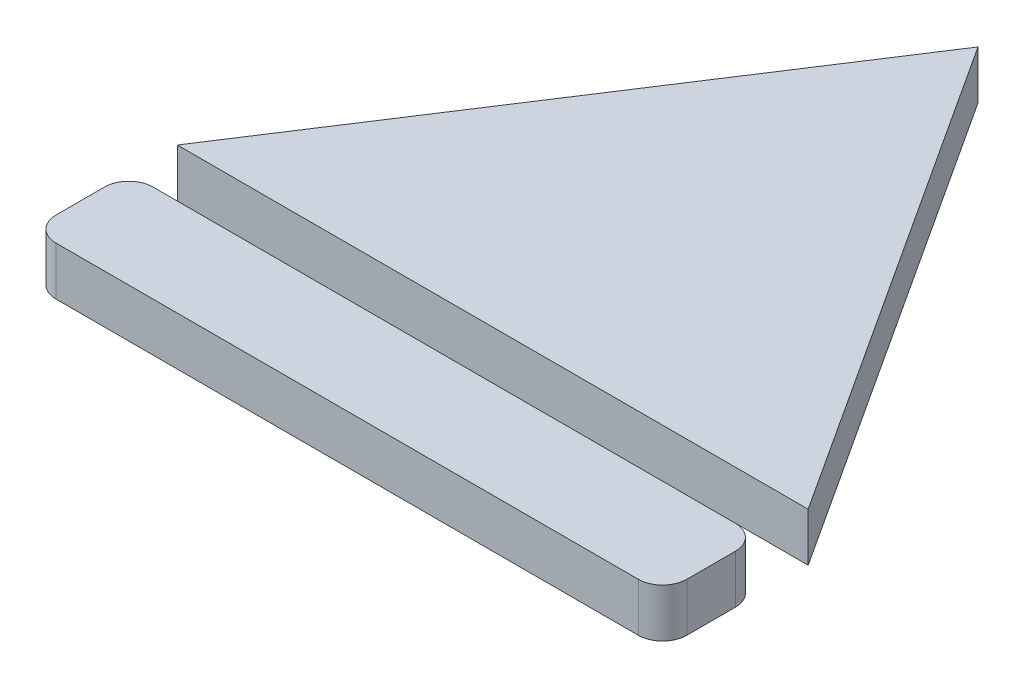
ISO-10303-21;
HEADER;
FILE_DESCRIPTION(('STEP AP214'),'2;1');
FILE_NAME('part.step','',(''),(''),'','','');
FILE_SCHEMA(('AUTOMOTIVE_DESIGN { 1 0 10303 214 1 1 1 1 }'));
ENDSEC;
DATA;
#1=APPLICATION_CONTEXT('core data for automotive mechanical design processes');
#2=APPLICATION_PROTOCOL_DEFINITION('international standard','automotive_design',2000,#1);
#3=PRODUCT_CONTEXT('',#1,'mechanical');
#4=PRODUCT('Part','Part','',(#3));
#5=PRODUCT_RELATED_PRODUCT_CATEGORY('part','',(#4));
#6=PRODUCT_DEFINITION_FORMATION('','',#4);
#7=PRODUCT_DEFINITION_CONTEXT('part definition',#1,'design');
#8=PRODUCT_DEFINITION('design','',#6,#7);
#9=PRODUCT_DEFINITION_SHAPE('','',#8);
#10=(LENGTH_UNIT() NAMED_UNIT(*) SI_UNIT(.MILLI.,.METRE.));
#11=(NAMED_UNIT(*) PLANE_ANGLE_UNIT() SI_UNIT($,.RADIAN.));
#12=(NAMED_UNIT(*) SI_UNIT($,.STERADIAN.) SOLID_ANGLE_UNIT());
#13=UNCERTAINTY_MEASURE_WITH_UNIT(LENGTH_MEASURE(1.E-05),#10,'distance_accuracy_value','');
#14=(GEOMETRIC_REPRESENTATION_CONTEXT(3) GLOBAL_UNCERTAINTY_ASSIGNED_CONTEXT((#13)) GLOBAL_UNIT_ASSIGNED_CONTEXT((#10,
#11,#12)) REPRESENTATION_CONTEXT('',''));
#15=CARTESIAN_POINT('',(0.,0.,0.));
#16=DIRECTION('',(0.,0.,1.));
#17=DIRECTION('',(1.,0.,0.));
#18=AXIS2_PLACEMENT_3D('',#15,#16,#17);
#19=CARTESIAN_POINT('',(12.5,1.,2.5));
#20=DIRECTION('',(0.,-1.,0.));
#21=DIRECTION('',(0.,0.,-1.));
#22=AXIS2_PLACEMENT_3D('',#19,#20,#21);
#23=CYLINDRICAL_SURFACE('',#22,0.5);
#24=CARTESIAN_POINT('',(12.5,0.,2.5));
#25=DIRECTION('',(0.,1.,0.));
#26=DIRECTION('',(0.,0.,1.));
#27=AXIS2_PLACEMENT_3D('',#24,#25,#26);
#28=CIRCLE('',#27,0.5);
#29=CARTESIAN_POINT('',(12.5,0.,3.));
#30=VERTEX_POINT('',#29);
#31=CARTESIAN_POINT('',(13.,0.,2.5));
#32=VERTEX_POINT('',#31);
#33=EDGE_CURVE('E12',#30,#32,#28,.T.);
#34=ORIENTED_EDGE('',*,*,#33,.T.);
#35=DIRECTION('',(0.,-1.,0.));
#36=VECTOR('',#35,1.);
#37=CARTESIAN_POINT('',(13.,1.,2.5));
#38=LINE('',#37,#36);
#39=CARTESIAN_POINT('',(13.,1.,2.5));
#40=VERTEX_POINT('',#39);
#41=EDGE_CURVE('E191',#40,#32,#38,.T.);
#42=ORIENTED_EDGE('',*,*,#41,.F.);
#43=CARTESIAN_POINT('',(12.5,1.,2.5));
#44=DIRECTION('',(0.,1.,0.));
#45=DIRECTION('',(0.,0.,1.));
#46=AXIS2_PLACEMENT_3D('',#43,#44,#45);
#47=CIRCLE('',#46,0.5);
#48=CARTESIAN_POINT('',(12.5,1.,3.));
#49=VERTEX_POINT('',#48);
#50=EDGE_CURVE('E59',#49,#40,#47,.T.);
#51=ORIENTED_EDGE('',*,*,#50,.F.);
#52=DIRECTION('',(0.,-1.,0.));
#53=VECTOR('',#52,1.);
#54=CARTESIAN_POINT('',(12.5,1.,3.));
#55=LINE('',#54,#53);
#56=EDGE_CURVE('E159',#49,#30,#55,.T.);
#57=ORIENTED_EDGE('',*,*,#56,.T.);
#58=EDGE_LOOP('',(#34,#42,#51,#57));
#59=FACE_BOUND('',#58,.T.);
#60=ADVANCED_FACE('F55',(#59),#23,.T.);
#61=CARTESIAN_POINT('',(13.,1.,1.5));
#62=DIRECTION('',(-1.,0.,0.));
#63=DIRECTION('',(0.,0.,1.));
#64=AXIS2_PLACEMENT_3D('',#61,#62,#63);
#65=PLANE('',#64);
#66=DIRECTION('',(0.,0.,-1.));
#67=VECTOR('',#66,1.);
#68=CARTESIAN_POINT('',(13.,0.,1.5));
#69=LINE('',#68,#67);
#70=CARTESIAN_POINT('',(13.,0.,1.5));
#71=VERTEX_POINT('',#70);
#72=EDGE_CURVE('E65',#32,#71,#69,.T.);
#73=ORIENTED_EDGE('',*,*,#72,.T.);
#74=DIRECTION('',(0.,-1.,0.));
#75=VECTOR('',#74,1.);
#76=CARTESIAN_POINT('',(13.,1.,1.5));
#77=LINE('',#76,#75);
#78=CARTESIAN_POINT('',(13.,1.,1.5));
#79=VERTEX_POINT('',#78);
#80=EDGE_CURVE('E135',#79,#71,#77,.T.);
#81=ORIENTED_EDGE('',*,*,#80,.F.);
#82=DIRECTION('',(0.,0.,-1.));
#83=VECTOR('',#82,1.);
#84=CARTESIAN_POINT('',(13.,1.,1.5));
#85=LINE('',#84,#83);
#86=EDGE_CURVE('E101',#40,#79,#85,.T.);
#87=ORIENTED_EDGE('',*,*,#86,.F.);
#88=ORIENTED_EDGE('',*,*,#41,.T.);
#89=EDGE_LOOP('',(#73,#81,#87,#88));
#90=FACE_BOUND('',#89,.T.);
#91=ADVANCED_FACE('F197',(#90),#65,.F.);
#92=CARTESIAN_POINT('',(12.5,1.,1.5));
#93=DIRECTION('',(0.,-1.,0.));
#94=DIRECTION('',(0.,0.,-1.));
#95=AXIS2_PLACEMENT_3D('',#92,#93,#94);
#96=CYLINDRICAL_SURFACE('',#95,0.5);
#97=CARTESIAN_POINT('',(12.5,0.,1.5));
#98=DIRECTION('',(0.,1.,0.));
#99=DIRECTION('',(0.,0.,-1.));
#100=AXIS2_PLACEMENT_3D('',#97,#98,#99);
#101=CIRCLE('',#100,0.5);
#102=CARTESIAN_POINT('',(12.5,0.,1.));
#103=VERTEX_POINT('',#102);
#104=EDGE_CURVE('E129',#71,#103,#101,.T.);
#105=ORIENTED_EDGE('',*,*,#104,.T.);
#106=DIRECTION('',(0.,-1.,0.));
#107=VECTOR('',#106,1.);
#108=CARTESIAN_POINT('',(12.5,1.,1.));
#109=LINE('',#108,#107);
#110=CARTESIAN_POINT('',(12.5,1.,1.));
#111=VERTEX_POINT('',#110);
#112=EDGE_CURVE('E133',#111,#103,#109,.T.);
#113=ORIENTED_EDGE('',*,*,#112,.F.);
#114=CARTESIAN_POINT('',(12.5,1.,1.5));
#115=DIRECTION('',(0.,1.,0.));
#116=DIRECTION('',(0.,0.,-1.));
#117=AXIS2_PLACEMENT_3D('',#114,#115,#116);
#118=CIRCLE('',#117,0.5);
#119=EDGE_CURVE('E166',#79,#111,#118,.T.);
#120=ORIENTED_EDGE('',*,*,#119,.F.);
#121=ORIENTED_EDGE('',*,*,#80,.T.);
#122=EDGE_LOOP('',(#105,#113,#120,#121));
#123=FACE_BOUND('',#122,.T.);
#124=ADVANCED_FACE('F131',(#123),#96,.T.);
#125=CARTESIAN_POINT('',(0.500000000000003,1.,1.));
#126=DIRECTION('',(0.,0.,1.));
#127=DIRECTION('',(1.,0.,0.));
#128=AXIS2_PLACEMENT_3D('',#125,#126,#127);
#129=PLANE('',#128);
#130=DIRECTION('',(-1.,0.,0.));
#131=VECTOR('',#130,1.);
#132=CARTESIAN_POINT('',(0.500000000000003,0.,1.));
#133=LINE('',#132,#131);
#134=CARTESIAN_POINT('',(0.500000000000003,0.,1.));
#135=VERTEX_POINT('',#134);
#136=EDGE_CURVE('E137',#103,#135,#133,.T.);
#137=ORIENTED_EDGE('',*,*,#136,.T.);
#138=DIRECTION('',(0.,-1.,0.));
#139=VECTOR('',#138,1.);
#140=CARTESIAN_POINT('',(0.500000000000003,1.,1.));
#141=LINE('',#140,#139);
#142=CARTESIAN_POINT('',(0.500000000000003,1.,1.));
#143=VERTEX_POINT('',#142);
#144=EDGE_CURVE('E144',#143,#135,#141,.T.);
#145=ORIENTED_EDGE('',*,*,#144,.F.);
#146=DIRECTION('',(-1.,0.,0.));
#147=VECTOR('',#146,1.);
#148=CARTESIAN_POINT('',(0.500000000000003,1.,1.));
#149=LINE('',#148,#147);
#150=EDGE_CURVE('E143',#111,#143,#149,.T.);
#151=ORIENTED_EDGE('',*,*,#150,.F.);
#152=ORIENTED_EDGE('',*,*,#112,.T.);
#153=EDGE_LOOP('',(#137,#145,#151,#152));
#154=FACE_BOUND('',#153,.T.);
#155=ADVANCED_FACE('F140',(#154),#129,.F.);
#156=CARTESIAN_POINT('',(0.5,1.,1.5));
#157=DIRECTION('',(0.,-1.,0.));
#158=DIRECTION('',(0.,0.,-1.));
#159=AXIS2_PLACEMENT_3D('',#156,#157,#158);
#160=CYLINDRICAL_SURFACE('',#159,0.5);
#161=CARTESIAN_POINT('',(0.5,0.,1.5));
#162=DIRECTION('',(0.,1.,0.));
#163=DIRECTION('',(0.,0.,1.));
#164=AXIS2_PLACEMENT_3D('',#161,#162,#163);
#165=CIRCLE('',#164,0.5);
#166=CARTESIAN_POINT('',(0.,0.,1.5));
#167=VERTEX_POINT('',#166);
#168=EDGE_CURVE('E149',#135,#167,#165,.T.);
#169=ORIENTED_EDGE('',*,*,#168,.T.);
#170=DIRECTION('',(0.,-1.,0.));
#171=VECTOR('',#170,1.);
#172=CARTESIAN_POINT('',(0.,1.,1.5));
#173=LINE('',#172,#171);
#174=CARTESIAN_POINT('',(0.,1.,1.5));
#175=VERTEX_POINT('',#174);
#176=EDGE_CURVE('E183',#175,#167,#173,.T.);
#177=ORIENTED_EDGE('',*,*,#176,.F.);
#178=CARTESIAN_POINT('',(0.5,1.,1.5));
#179=DIRECTION('',(0.,1.,0.));
#180=DIRECTION('',(0.,0.,1.));
#181=AXIS2_PLACEMENT_3D('',#178,#179,#180);
#182=CIRCLE('',#181,0.5);
#183=EDGE_CURVE('E163',#143,#175,#182,.T.);
#184=ORIENTED_EDGE('',*,*,#183,.F.);
#185=ORIENTED_EDGE('',*,*,#144,.T.);
#186=EDGE_LOOP('',(#169,#177,#184,#185));
#187=FACE_BOUND('',#186,.T.);
#188=ADVANCED_FACE('F200',(#187),#160,.T.);
#189=CARTESIAN_POINT('',(0.,1.,1.5));
#190=DIRECTION('',(1.,0.,0.));
#191=DIRECTION('',(0.,0.,-1.));
#192=AXIS2_PLACEMENT_3D('',#189,#190,#191);
#193=PLANE('',#192);
#194=DIRECTION('',(0.,0.,1.));
#195=VECTOR('',#194,1.);
#196=CARTESIAN_POINT('',(0.,0.,1.5));
#197=LINE('',#196,#195);
#198=CARTESIAN_POINT('',(0.,0.,2.5));
#199=VERTEX_POINT('',#198);
#200=EDGE_CURVE('E151',#167,#199,#197,.T.);
#201=ORIENTED_EDGE('',*,*,#200,.T.);
#202=DIRECTION('',(0.,-1.,0.));
#203=VECTOR('',#202,1.);
#204=CARTESIAN_POINT('',(0.,1.,2.5));
#205=LINE('',#204,#203);
#206=CARTESIAN_POINT('',(0.,1.,2.5));
#207=VERTEX_POINT('',#206);
#208=EDGE_CURVE('E180',#207,#199,#205,.T.);
#209=ORIENTED_EDGE('',*,*,#208,.F.);
#210=DIRECTION('',(0.,0.,1.));
#211=VECTOR('',#210,1.);
#212=CARTESIAN_POINT('',(0.,1.,1.5));
#213=LINE('',#212,#211);
#214=EDGE_CURVE('E161',#175,#207,#213,.T.);
#215=ORIENTED_EDGE('',*,*,#214,.F.);
#216=ORIENTED_EDGE('',*,*,#176,.T.);
#217=EDGE_LOOP('',(#201,#209,#215,#216));
#218=FACE_BOUND('',#217,.T.);
#219=ADVANCED_FACE('F178',(#218),#193,.F.);
#220=CARTESIAN_POINT('',(0.5,1.,2.5));
#221=DIRECTION('',(0.,-1.,0.));
#222=DIRECTION('',(0.,0.,-1.));
#223=AXIS2_PLACEMENT_3D('',#220,#221,#222);
#224=CYLINDRICAL_SURFACE('',#223,0.5);
#225=CARTESIAN_POINT('',(0.5,0.,2.5));
#226=DIRECTION('',(0.,1.,0.));
#227=DIRECTION('',(0.,0.,1.));
#228=AXIS2_PLACEMENT_3D('',#225,#226,#227);
#229=CIRCLE('',#228,0.5);
#230=CARTESIAN_POINT('',(0.500000000000004,0.,3.));
#231=VERTEX_POINT('',#230);
#232=EDGE_CURVE('E169',#199,#231,#229,.T.);
#233=ORIENTED_EDGE('',*,*,#232,.T.);
#234=DIRECTION('',(0.,-1.,0.));
#235=VECTOR('',#234,1.);
#236=CARTESIAN_POINT('',(0.500000000000004,1.,3.));
#237=LINE('',#236,#235);
#238=CARTESIAN_POINT('',(0.500000000000004,1.,3.));
#239=VERTEX_POINT('',#238);
#240=EDGE_CURVE('E188',#239,#231,#237,.T.);
#241=ORIENTED_EDGE('',*,*,#240,.F.);
#242=CARTESIAN_POINT('',(0.5,1.,2.5));
#243=DIRECTION('',(0.,1.,0.));
#244=DIRECTION('',(0.,0.,1.));
#245=AXIS2_PLACEMENT_3D('',#242,#243,#244);
#246=CIRCLE('',#245,0.5);
#247=EDGE_CURVE('E158',#207,#239,#246,.T.);
#248=ORIENTED_EDGE('',*,*,#247,.F.);
#249=ORIENTED_EDGE('',*,*,#208,.T.);
#250=EDGE_LOOP('',(#233,#241,#248,#249));
#251=FACE_BOUND('',#250,.T.);
#252=ADVANCED_FACE('F186',(#251),#224,.T.);
#253=CARTESIAN_POINT('',(0.500000000000004,1.,3.));
#254=DIRECTION('',(0.,0.,-1.));
#255=DIRECTION('',(-1.,0.,0.));
#256=AXIS2_PLACEMENT_3D('',#253,#254,#255);
#257=PLANE('',#256);
#258=DIRECTION('',(1.,0.,0.));
#259=VECTOR('',#258,1.);
#260=CARTESIAN_POINT('',(0.500000000000004,0.,3.));
#261=LINE('',#260,#259);
#262=EDGE_CURVE('E112',#231,#30,#261,.T.);
#263=ORIENTED_EDGE('',*,*,#262,.T.);
#264=ORIENTED_EDGE('',*,*,#56,.F.);
#265=DIRECTION('',(1.,0.,0.));
#266=VECTOR('',#265,1.);
#267=CARTESIAN_POINT('',(0.500000000000004,1.,3.));
#268=LINE('',#267,#266);
#269=EDGE_CURVE('E156',#239,#49,#268,.T.);
#270=ORIENTED_EDGE('',*,*,#269,.F.);
#271=ORIENTED_EDGE('',*,*,#240,.T.);
#272=EDGE_LOOP('',(#263,#264,#270,#271));
#273=FACE_BOUND('',#272,.T.);
#274=ADVANCED_FACE('F201',(#273),#257,.F.);
#275=CARTESIAN_POINT('',(12.5,1.,2.5));
#276=DIRECTION('',(0.,1.,0.));
#277=DIRECTION('',(0.,0.,1.));
#278=AXIS2_PLACEMENT_3D('',#275,#276,#277);
#279=PLANE('',#278);
#280=ORIENTED_EDGE('',*,*,#50,.T.);
#281=ORIENTED_EDGE('',*,*,#86,.T.);
#282=ORIENTED_EDGE('',*,*,#119,.T.);
#283=ORIENTED_EDGE('',*,*,#150,.T.);
#284=ORIENTED_EDGE('',*,*,#183,.T.);
#285=ORIENTED_EDGE('',*,*,#214,.T.);
#286=ORIENTED_EDGE('',*,*,#247,.T.);
#287=ORIENTED_EDGE('',*,*,#269,.T.);
#288=EDGE_LOOP('',(#280,#281,#282,#283,#284,#285,#286,#287));
#289=FACE_BOUND('',#288,.T.);
#290=ADVANCED_FACE('F57',(#289),#279,.T.);
#291=CARTESIAN_POINT('',(12.5,0.,2.5));
#292=DIRECTION('',(0.,1.,0.));
#293=DIRECTION('',(0.,0.,1.));
#294=AXIS2_PLACEMENT_3D('',#291,#292,#293);
#295=PLANE('',#294);
#296=ORIENTED_EDGE('',*,*,#33,.F.);
#297=ORIENTED_EDGE('',*,*,#262,.F.);
#298=ORIENTED_EDGE('',*,*,#232,.F.);
#299=ORIENTED_EDGE('',*,*,#200,.F.);
#300=ORIENTED_EDGE('',*,*,#168,.F.);
#301=ORIENTED_EDGE('',*,*,#136,.F.);
#302=ORIENTED_EDGE('',*,*,#104,.F.);
#303=ORIENTED_EDGE('',*,*,#72,.F.);
#304=EDGE_LOOP('',(#296,#297,#298,#299,#300,#301,#302,#303));
#305=FACE_BOUND('',#304,.T.);
#306=ADVANCED_FACE('F147',(#305),#295,.F.);
#307=CLOSED_SHELL('',(#60,#91,#124,#155,#188,#219,#252,#274,#290,#306));
#308=MANIFOLD_SOLID_BREP('B2',#307);
#309=CARTESIAN_POINT('',(6.5,1.,-10.));
#310=DIRECTION('',(0.838443616300637,0.,0.544988350595414));
#311=DIRECTION('',(0.544988350595414,0.,-0.838443616300637));
#312=AXIS2_PLACEMENT_3D('',#309,#310,#311);
#313=PLANE('',#312);
#314=DIRECTION('',(-0.544988350595414,0.,0.838443616300637));
#315=VECTOR('',#314,1.);
#316=CARTESIAN_POINT('',(6.5,0.,-10.));
#317=LINE('',#316,#315);
#318=CARTESIAN_POINT('',(6.5,0.,-10.));
#319=VERTEX_POINT('',#318);
#320=CARTESIAN_POINT('',(0.,0.,0.));
#321=VERTEX_POINT('',#320);
#322=EDGE_CURVE('E333',#319,#321,#317,.T.);
#323=ORIENTED_EDGE('',*,*,#322,.T.);
#324=DIRECTION('',(0.,-1.,0.));
#325=VECTOR('',#324,1.);
#326=CARTESIAN_POINT('',(0.,1.,0.));
#327=LINE('',#326,#325);
#328=CARTESIAN_POINT('',(0.,1.,0.));
#329=VERTEX_POINT('',#328);
#330=EDGE_CURVE('E53',#329,#321,#327,.T.);
#331=ORIENTED_EDGE('',*,*,#330,.F.);
#332=DIRECTION('',(-0.544988350595414,0.,0.838443616300637));
#333=VECTOR('',#332,1.);
#334=CARTESIAN_POINT('',(6.5,1.,-10.));
#335=LINE('',#334,#333);
#336=CARTESIAN_POINT('',(6.5,1.,-10.));
#337=VERTEX_POINT('',#336);
#338=EDGE_CURVE('E325',#337,#329,#335,.T.);
#339=ORIENTED_EDGE('',*,*,#338,.F.);
#340=DIRECTION('',(0.,-1.,0.));
#341=VECTOR('',#340,1.);
#342=CARTESIAN_POINT('',(6.5,1.,-10.));
#343=LINE('',#342,#341);
#344=EDGE_CURVE('E334',#337,#319,#343,.T.);
#345=ORIENTED_EDGE('',*,*,#344,.T.);
#346=EDGE_LOOP('',(#323,#331,#339,#345));
#347=FACE_BOUND('',#346,.T.);
#348=ADVANCED_FACE('F283',(#347),#313,.F.);
#349=CARTESIAN_POINT('',(0.,1.,0.));
#350=DIRECTION('',(0.,0.,-1.));
#351=DIRECTION('',(-1.,0.,0.));
#352=AXIS2_PLACEMENT_3D('',#349,#350,#351);
#353=PLANE('',#352);
#354=DIRECTION('',(1.,0.,0.));
#355=VECTOR('',#354,1.);
#356=CARTESIAN_POINT('',(0.,0.,0.));
#357=LINE('',#356,#355);
#358=CARTESIAN_POINT('',(13.,0.,0.));
#359=VERTEX_POINT('',#358);
#360=EDGE_CURVE('E312',#321,#359,#357,.T.);
#361=ORIENTED_EDGE('',*,*,#360,.T.);
#362=DIRECTION('',(0.,-1.,0.));
#363=VECTOR('',#362,1.);
#364=CARTESIAN_POINT('',(13.,1.,0.));
#365=LINE('',#364,#363);
#366=CARTESIAN_POINT('',(13.,1.,0.));
#367=VERTEX_POINT('',#366);
#368=EDGE_CURVE('E292',#367,#359,#365,.T.);
#369=ORIENTED_EDGE('',*,*,#368,.F.);
#370=DIRECTION('',(1.,0.,0.));
#371=VECTOR('',#370,1.);
#372=CARTESIAN_POINT('',(0.,1.,0.));
#373=LINE('',#372,#371);
#374=EDGE_CURVE('E320',#329,#367,#373,.T.);
#375=ORIENTED_EDGE('',*,*,#374,.F.);
#376=ORIENTED_EDGE('',*,*,#330,.T.);
#377=EDGE_LOOP('',(#361,#369,#375,#376));
#378=FACE_BOUND('',#377,.T.);
#379=ADVANCED_FACE('F321',(#378),#353,.F.);
#380=CARTESIAN_POINT('',(13.,1.,0.));
#381=DIRECTION('',(-0.838443616300637,0.,0.544988350595414));
#382=DIRECTION('',(0.544988350595414,0.,0.838443616300637));
#383=AXIS2_PLACEMENT_3D('',#380,#381,#382);
#384=PLANE('',#383);
#385=DIRECTION('',(-0.544988350595414,0.,-0.838443616300637));
#386=VECTOR('',#385,1.);
#387=CARTESIAN_POINT('',(13.,0.,0.));
#388=LINE('',#387,#386);
#389=EDGE_CURVE('E317',#359,#319,#388,.T.);
#390=ORIENTED_EDGE('',*,*,#389,.T.);
#391=ORIENTED_EDGE('',*,*,#344,.F.);
#392=DIRECTION('',(-0.544988350595414,0.,-0.838443616300637));
#393=VECTOR('',#392,1.);
#394=CARTESIAN_POINT('',(13.,1.,0.));
#395=LINE('',#394,#393);
#396=EDGE_CURVE('E300',#367,#337,#395,.T.);
#397=ORIENTED_EDGE('',*,*,#396,.F.);
#398=ORIENTED_EDGE('',*,*,#368,.T.);
#399=EDGE_LOOP('',(#390,#391,#397,#398));
#400=FACE_BOUND('',#399,.T.);
#401=ADVANCED_FACE('F346',(#400),#384,.F.);
#402=CARTESIAN_POINT('',(0.,1.,0.));
#403=DIRECTION('',(0.,-1.,0.));
#404=DIRECTION('',(0.,0.,-1.));
#405=AXIS2_PLACEMENT_3D('',#402,#403,#404);
#406=PLANE('',#405);
#407=ORIENTED_EDGE('',*,*,#338,.T.);
#408=ORIENTED_EDGE('',*,*,#374,.T.);
#409=ORIENTED_EDGE('',*,*,#396,.T.);
#410=EDGE_LOOP('',(#407,#408,#409));
#411=FACE_BOUND('',#410,.T.);
#412=ADVANCED_FACE('F328',(#411),#406,.F.);
#413=CARTESIAN_POINT('',(0.,0.,0.));
#414=DIRECTION('',(0.,-1.,0.));
#415=DIRECTION('',(0.,0.,-1.));
#416=AXIS2_PLACEMENT_3D('',#413,#414,#415);
#417=PLANE('',#416);
#418=ORIENTED_EDGE('',*,*,#322,.F.);
#419=ORIENTED_EDGE('',*,*,#389,.F.);
#420=ORIENTED_EDGE('',*,*,#360,.F.);
#421=EDGE_LOOP('',(#418,#419,#420));
#422=FACE_BOUND('',#421,.T.);
#423=ADVANCED_FACE('F347',(#422),#417,.T.);
#424=CLOSED_SHELL('',(#348,#379,#401,#412,#423));
#425=MANIFOLD_SOLID_BREP('B6',#424);
#426=ADVANCED_BREP_SHAPE_REPRESENTATION('',(#18,#308,#425),#14);
#427=SHAPE_DEFINITION_REPRESENTATION(#9,#426);
ENDSEC;
END-ISO-10303-21;
